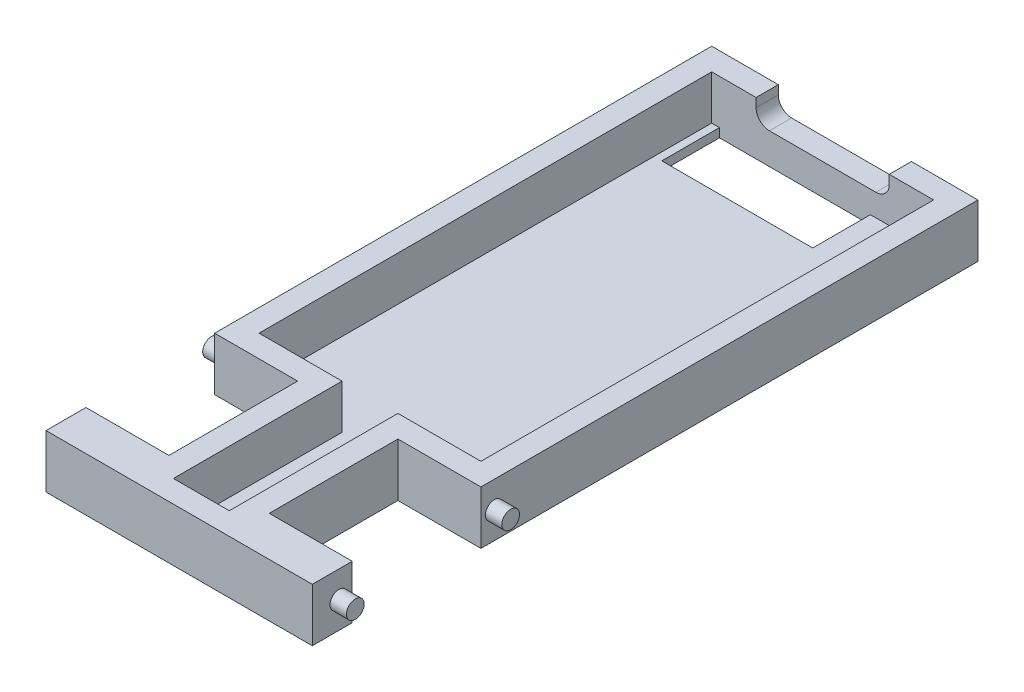
ISO-10303-21;
HEADER;
FILE_DESCRIPTION(('STEP AP214'),'2;1');
FILE_NAME('part.step','',(''),(''),'','','');
FILE_SCHEMA(('AUTOMOTIVE_DESIGN { 1 0 10303 214 1 1 1 1 }'));
ENDSEC;
DATA;
#1=APPLICATION_CONTEXT('core data for automotive mechanical design processes');
#2=APPLICATION_PROTOCOL_DEFINITION('international standard','automotive_design',2000,#1);
#3=PRODUCT_CONTEXT('',#1,'mechanical');
#4=PRODUCT('Part','Part','',(#3));
#5=PRODUCT_RELATED_PRODUCT_CATEGORY('part','',(#4));
#6=PRODUCT_DEFINITION_FORMATION('','',#4);
#7=PRODUCT_DEFINITION_CONTEXT('part definition',#1,'design');
#8=PRODUCT_DEFINITION('design','',#6,#7);
#9=PRODUCT_DEFINITION_SHAPE('','',#8);
#10=(LENGTH_UNIT() NAMED_UNIT(*) SI_UNIT(.MILLI.,.METRE.));
#11=(NAMED_UNIT(*) PLANE_ANGLE_UNIT() SI_UNIT($,.RADIAN.));
#12=(NAMED_UNIT(*) SI_UNIT($,.STERADIAN.) SOLID_ANGLE_UNIT());
#13=UNCERTAINTY_MEASURE_WITH_UNIT(LENGTH_MEASURE(1.E-05),#10,'distance_accuracy_value','');
#14=(GEOMETRIC_REPRESENTATION_CONTEXT(3) GLOBAL_UNCERTAINTY_ASSIGNED_CONTEXT((#13)) GLOBAL_UNIT_ASSIGNED_CONTEXT((#10,
#11,#12)) REPRESENTATION_CONTEXT('',''));
#15=CARTESIAN_POINT('',(0.,0.,0.));
#16=DIRECTION('',(0.,0.,1.));
#17=DIRECTION('',(1.,0.,0.));
#18=AXIS2_PLACEMENT_3D('',#15,#16,#17);
#19=CARTESIAN_POINT('',(60.,10.,0.));
#20=DIRECTION('',(1.,0.,0.));
#21=DIRECTION('',(0.,0.,-1.));
#22=AXIS2_PLACEMENT_3D('',#19,#20,#21);
#23=PLANE('',#22);
#24=CARTESIAN_POINT('',(60.,4.,144.));
#25=DIRECTION('',(1.,0.,0.));
#26=DIRECTION('',(0.,0.,-1.));
#27=AXIS2_PLACEMENT_3D('',#24,#25,#26);
#28=CIRCLE('',#27,2.);
#29=CARTESIAN_POINT('',(60.,4.,142.));
#30=VERTEX_POINT('',#29);
#31=EDGE_CURVE('E307',#30,#30,#28,.T.);
#32=ORIENTED_EDGE('',*,*,#31,.F.);
#33=EDGE_LOOP('',(#32));
#34=FACE_BOUND('',#33,.T.);
#35=DIRECTION('',(0.,0.,1.));
#36=VECTOR('',#35,1.);
#37=CARTESIAN_POINT('',(60.,-2.,0.));
#38=LINE('',#37,#36);
#39=CARTESIAN_POINT('',(60.,-2.,141.));
#40=VERTEX_POINT('',#39);
#41=CARTESIAN_POINT('',(60.,-2.,150.));
#42=VERTEX_POINT('',#41);
#43=EDGE_CURVE('E475',#40,#42,#38,.T.);
#44=ORIENTED_EDGE('',*,*,#43,.F.);
#45=DIRECTION('',(0.,1.,0.));
#46=VECTOR('',#45,1.);
#47=CARTESIAN_POINT('',(60.,-2.,141.));
#48=LINE('',#47,#46);
#49=CARTESIAN_POINT('',(60.,10.,141.));
#50=VERTEX_POINT('',#49);
#51=EDGE_CURVE('E428',#40,#50,#48,.T.);
#52=ORIENTED_EDGE('',*,*,#51,.T.);
#53=DIRECTION('',(0.,0.,1.));
#54=VECTOR('',#53,1.);
#55=CARTESIAN_POINT('',(60.,10.,0.));
#56=LINE('',#55,#54);
#57=CARTESIAN_POINT('',(60.,10.,150.));
#58=VERTEX_POINT('',#57);
#59=EDGE_CURVE('E284',#50,#58,#56,.T.);
#60=ORIENTED_EDGE('',*,*,#59,.T.);
#61=DIRECTION('',(0.,-1.,0.));
#62=VECTOR('',#61,1.);
#63=CARTESIAN_POINT('',(60.,10.,150.));
#64=LINE('',#63,#62);
#65=EDGE_CURVE('E270',#58,#42,#64,.T.);
#66=ORIENTED_EDGE('',*,*,#65,.T.);
#67=EDGE_LOOP('',(#44,#52,#60,#66));
#68=FACE_BOUND('',#67,.T.);
#69=ADVANCED_FACE('F36',(#34,#68),#23,.T.);
#70=CARTESIAN_POINT('',(0.,10.,0.));
#71=DIRECTION('',(1.,0.,0.));
#72=DIRECTION('',(0.,0.,-1.));
#73=AXIS2_PLACEMENT_3D('',#70,#71,#72);
#74=PLANE('',#73);
#75=CARTESIAN_POINT('',(0.,3.99999999999999,109.));
#76=DIRECTION('',(1.,0.,0.));
#77=DIRECTION('',(0.,0.,-1.));
#78=AXIS2_PLACEMENT_3D('',#75,#76,#77);
#79=CIRCLE('',#78,2.);
#80=CARTESIAN_POINT('',(0.,3.99999999999999,107.));
#81=VERTEX_POINT('',#80);
#82=EDGE_CURVE('E290',#81,#81,#79,.F.);
#83=ORIENTED_EDGE('',*,*,#82,.F.);
#84=EDGE_LOOP('',(#83));
#85=FACE_BOUND('',#84,.T.);
#86=DIRECTION('',(0.,1.,0.));
#87=VECTOR('',#86,1.);
#88=CARTESIAN_POINT('',(0.,-2.00000000000001,112.));
#89=LINE('',#88,#87);
#90=CARTESIAN_POINT('',(0.,-2.00000000000001,112.));
#91=VERTEX_POINT('',#90);
#92=CARTESIAN_POINT('',(0.,10.,112.));
#93=VERTEX_POINT('',#92);
#94=EDGE_CURVE('E457',#91,#93,#89,.T.);
#95=ORIENTED_EDGE('',*,*,#94,.T.);
#96=DIRECTION('',(0.,0.,1.));
#97=VECTOR('',#96,1.);
#98=CARTESIAN_POINT('',(0.,10.,0.));
#99=LINE('',#98,#97);
#100=CARTESIAN_POINT('',(0.,10.,0.));
#101=VERTEX_POINT('',#100);
#102=EDGE_CURVE('E259',#101,#93,#99,.T.);
#103=ORIENTED_EDGE('',*,*,#102,.F.);
#104=DIRECTION('',(0.,-1.,0.));
#105=VECTOR('',#104,1.);
#106=CARTESIAN_POINT('',(0.,10.,0.));
#107=LINE('',#106,#105);
#108=CARTESIAN_POINT('',(0.,-2.,0.));
#109=VERTEX_POINT('',#108);
#110=EDGE_CURVE('E296',#101,#109,#107,.T.);
#111=ORIENTED_EDGE('',*,*,#110,.T.);
#112=DIRECTION('',(0.,0.,1.));
#113=VECTOR('',#112,1.);
#114=CARTESIAN_POINT('',(0.,-2.,0.));
#115=LINE('',#114,#113);
#116=EDGE_CURVE('E489',#109,#91,#115,.T.);
#117=ORIENTED_EDGE('',*,*,#116,.T.);
#118=EDGE_LOOP('',(#95,#103,#111,#117));
#119=FACE_BOUND('',#118,.T.);
#120=ADVANCED_FACE('F543',(#85,#119),#74,.F.);
#121=CARTESIAN_POINT('',(5.00000000000002,10.,0.));
#122=DIRECTION('',(1.,0.,0.));
#123=DIRECTION('',(0.,0.,-1.));
#124=AXIS2_PLACEMENT_3D('',#121,#122,#123);
#125=PLANE('',#124);
#126=DIRECTION('',(0.,-1.,0.));
#127=VECTOR('',#126,1.);
#128=CARTESIAN_POINT('',(5.00000000000002,52.3519775217167,107.));
#129=LINE('',#128,#127);
#130=CARTESIAN_POINT('',(5.00000000000002,10.,107.));
#131=VERTEX_POINT('',#130);
#132=CARTESIAN_POINT('',(5.00000000000002,0.,107.));
#133=VERTEX_POINT('',#132);
#134=EDGE_CURVE('E410',#131,#133,#129,.T.);
#135=ORIENTED_EDGE('',*,*,#134,.T.);
#136=DIRECTION('',(0.,0.,1.));
#137=VECTOR('',#136,1.);
#138=CARTESIAN_POINT('',(5.00000000000002,0.,0.));
#139=LINE('',#138,#137);
#140=CARTESIAN_POINT('',(5.00000000000002,0.,5.));
#141=VERTEX_POINT('',#140);
#142=EDGE_CURVE('E281',#141,#133,#139,.T.);
#143=ORIENTED_EDGE('',*,*,#142,.F.);
#144=DIRECTION('',(0.,-1.,0.));
#145=VECTOR('',#144,1.);
#146=CARTESIAN_POINT('',(5.00000000000002,10.,5.));
#147=LINE('',#146,#145);
#148=CARTESIAN_POINT('',(5.00000000000002,10.,5.));
#149=VERTEX_POINT('',#148);
#150=EDGE_CURVE('E285',#149,#141,#147,.T.);
#151=ORIENTED_EDGE('',*,*,#150,.F.);
#152=DIRECTION('',(0.,0.,1.));
#153=VECTOR('',#152,1.);
#154=CARTESIAN_POINT('',(5.00000000000002,10.,0.));
#155=LINE('',#154,#153);
#156=EDGE_CURVE('E267',#149,#131,#155,.T.);
#157=ORIENTED_EDGE('',*,*,#156,.T.);
#158=EDGE_LOOP('',(#135,#143,#151,#157));
#159=FACE_BOUND('',#158,.T.);
#160=ADVANCED_FACE('F549',(#159),#125,.T.);
#161=CARTESIAN_POINT('',(0.,10.,5.));
#162=DIRECTION('',(0.,0.,-1.));
#163=DIRECTION('',(-1.,0.,0.));
#164=AXIS2_PLACEMENT_3D('',#161,#162,#163);
#165=PLANE('',#164);
#166=DIRECTION('',(1.,0.,0.));
#167=VECTOR('',#166,1.);
#168=CARTESIAN_POINT('',(0.,10.,5.));
#169=LINE('',#168,#167);
#170=CARTESIAN_POINT('',(45.,10.,5.));
#171=VERTEX_POINT('',#170);
#172=CARTESIAN_POINT('',(55.,10.,5.));
#173=VERTEX_POINT('',#172);
#174=EDGE_CURVE('E243',#171,#173,#169,.T.);
#175=ORIENTED_EDGE('',*,*,#174,.F.);
#176=DIRECTION('',(0.,1.,0.));
#177=VECTOR('',#176,1.);
#178=CARTESIAN_POINT('',(45.,10.,5.));
#179=LINE('',#178,#177);
#180=CARTESIAN_POINT('',(45.,8.,5.));
#181=VERTEX_POINT('',#180);
#182=EDGE_CURVE('E229',#181,#171,#179,.T.);
#183=ORIENTED_EDGE('',*,*,#182,.F.);
#184=CARTESIAN_POINT('',(42.,8.,5.));
#185=DIRECTION('',(0.,0.,-1.));
#186=DIRECTION('',(-1.,0.,0.));
#187=AXIS2_PLACEMENT_3D('',#184,#185,#186);
#188=CIRCLE('',#187,3.);
#189=CARTESIAN_POINT('',(42.,5.,5.));
#190=VERTEX_POINT('',#189);
#191=EDGE_CURVE('E11',#181,#190,#188,.T.);
#192=ORIENTED_EDGE('',*,*,#191,.T.);
#193=DIRECTION('',(1.,0.,0.));
#194=VECTOR('',#193,1.);
#195=CARTESIAN_POINT('',(45.,5.,5.));
#196=LINE('',#195,#194);
#197=CARTESIAN_POINT('',(18.,5.,5.));
#198=VERTEX_POINT('',#197);
#199=EDGE_CURVE('E237',#198,#190,#196,.T.);
#200=ORIENTED_EDGE('',*,*,#199,.F.);
#201=CARTESIAN_POINT('',(18.,8.,5.));
#202=DIRECTION('',(0.,0.,-1.));
#203=DIRECTION('',(-1.,0.,0.));
#204=AXIS2_PLACEMENT_3D('',#201,#202,#203);
#205=CIRCLE('',#204,3.);
#206=CARTESIAN_POINT('',(15.,8.,5.));
#207=VERTEX_POINT('',#206);
#208=EDGE_CURVE('E333',#198,#207,#205,.T.);
#209=ORIENTED_EDGE('',*,*,#208,.T.);
#210=DIRECTION('',(0.,-1.,0.));
#211=VECTOR('',#210,1.);
#212=CARTESIAN_POINT('',(15.,10.,5.));
#213=LINE('',#212,#211);
#214=CARTESIAN_POINT('',(15.,10.,5.));
#215=VERTEX_POINT('',#214);
#216=EDGE_CURVE('E236',#215,#207,#213,.T.);
#217=ORIENTED_EDGE('',*,*,#216,.F.);
#218=EDGE_CURVE('E253',#149,#215,#169,.T.);
#219=ORIENTED_EDGE('',*,*,#218,.F.);
#220=ORIENTED_EDGE('',*,*,#150,.T.);
#221=DIRECTION('',(1.,0.,0.));
#222=VECTOR('',#221,1.);
#223=CARTESIAN_POINT('',(0.,0.,5.));
#224=LINE('',#223,#222);
#225=CARTESIAN_POINT('',(6.75,0.,5.));
#226=VERTEX_POINT('',#225);
#227=EDGE_CURVE('E271',#141,#226,#224,.T.);
#228=ORIENTED_EDGE('',*,*,#227,.T.);
#229=DIRECTION('',(0.,-1.,0.));
#230=VECTOR('',#229,1.);
#231=CARTESIAN_POINT('',(6.75,10.,5.));
#232=LINE('',#231,#230);
#233=CARTESIAN_POINT('',(6.75,-2.,5.));
#234=VERTEX_POINT('',#233);
#235=EDGE_CURVE('E347',#226,#234,#232,.T.);
#236=ORIENTED_EDGE('',*,*,#235,.T.);
#237=DIRECTION('',(-1.,0.,0.));
#238=VECTOR('',#237,1.);
#239=CARTESIAN_POINT('',(0.,-2.,5.));
#240=LINE('',#239,#238);
#241=CARTESIAN_POINT('',(40.75,-2.,5.));
#242=VERTEX_POINT('',#241);
#243=EDGE_CURVE('E310',#242,#234,#240,.T.);
#244=ORIENTED_EDGE('',*,*,#243,.F.);
#245=DIRECTION('',(0.,-1.,0.));
#246=VECTOR('',#245,1.);
#247=CARTESIAN_POINT('',(40.75,10.,5.));
#248=LINE('',#247,#246);
#249=CARTESIAN_POINT('',(40.75,0.,5.));
#250=VERTEX_POINT('',#249);
#251=EDGE_CURVE('E372',#250,#242,#248,.T.);
#252=ORIENTED_EDGE('',*,*,#251,.F.);
#253=CARTESIAN_POINT('',(55.,0.,5.));
#254=VERTEX_POINT('',#253);
#255=EDGE_CURVE('E275',#250,#254,#224,.T.);
#256=ORIENTED_EDGE('',*,*,#255,.T.);
#257=DIRECTION('',(0.,-1.,0.));
#258=VECTOR('',#257,1.);
#259=CARTESIAN_POINT('',(55.,10.,5.));
#260=LINE('',#259,#258);
#261=EDGE_CURVE('E252',#173,#254,#260,.T.);
#262=ORIENTED_EDGE('',*,*,#261,.F.);
#263=EDGE_LOOP('',(#175,#183,#192,#200,#209,#217,#219,#220,#228,#236,#244,#252,#256,#262));
#264=FACE_BOUND('',#263,.T.);
#265=ADVANCED_FACE('F250',(#264),#165,.F.);
#266=CARTESIAN_POINT('',(55.,10.,0.));
#267=DIRECTION('',(1.,0.,0.));
#268=DIRECTION('',(0.,0.,-1.));
#269=AXIS2_PLACEMENT_3D('',#266,#267,#268);
#270=PLANE('',#269);
#271=DIRECTION('',(0.,0.,1.));
#272=VECTOR('',#271,1.);
#273=CARTESIAN_POINT('',(55.,0.,0.));
#274=LINE('',#273,#272);
#275=CARTESIAN_POINT('',(55.,0.,107.));
#276=VERTEX_POINT('',#275);
#277=EDGE_CURVE('E274',#254,#276,#274,.T.);
#278=ORIENTED_EDGE('',*,*,#277,.T.);
#279=DIRECTION('',(0.,-1.,0.));
#280=VECTOR('',#279,1.);
#281=CARTESIAN_POINT('',(55.,52.3519775217167,107.));
#282=LINE('',#281,#280);
#283=CARTESIAN_POINT('',(55.,10.,107.));
#284=VERTEX_POINT('',#283);
#285=EDGE_CURVE('E397',#284,#276,#282,.T.);
#286=ORIENTED_EDGE('',*,*,#285,.F.);
#287=DIRECTION('',(0.,0.,1.));
#288=VECTOR('',#287,1.);
#289=CARTESIAN_POINT('',(55.,10.,0.));
#290=LINE('',#289,#288);
#291=EDGE_CURVE('E257',#173,#284,#290,.T.);
#292=ORIENTED_EDGE('',*,*,#291,.F.);
#293=ORIENTED_EDGE('',*,*,#261,.T.);
#294=EDGE_LOOP('',(#278,#286,#292,#293));
#295=FACE_BOUND('',#294,.T.);
#296=ADVANCED_FACE('F561',(#295),#270,.F.);
#297=CARTESIAN_POINT('',(0.,10.,145.));
#298=DIRECTION('',(0.,0.,-1.));
#299=DIRECTION('',(-1.,0.,0.));
#300=AXIS2_PLACEMENT_3D('',#297,#298,#299);
#301=PLANE('',#300);
#302=DIRECTION('',(0.,-1.,0.));
#303=VECTOR('',#302,1.);
#304=CARTESIAN_POINT('',(36.3,52.3519775217167,145.));
#305=LINE('',#304,#303);
#306=CARTESIAN_POINT('',(36.3,10.,145.));
#307=VERTEX_POINT('',#306);
#308=CARTESIAN_POINT('',(36.3,0.,145.));
#309=VERTEX_POINT('',#308);
#310=EDGE_CURVE('E390',#307,#309,#305,.T.);
#311=ORIENTED_EDGE('',*,*,#310,.T.);
#312=DIRECTION('',(1.,0.,0.));
#313=VECTOR('',#312,1.);
#314=CARTESIAN_POINT('',(0.,0.,145.));
#315=LINE('',#314,#313);
#316=CARTESIAN_POINT('',(23.7,0.,145.));
#317=VERTEX_POINT('',#316);
#318=EDGE_CURVE('E278',#317,#309,#315,.T.);
#319=ORIENTED_EDGE('',*,*,#318,.F.);
#320=DIRECTION('',(0.,-1.,0.));
#321=VECTOR('',#320,1.);
#322=CARTESIAN_POINT('',(23.7,52.3519775217167,145.));
#323=LINE('',#322,#321);
#324=CARTESIAN_POINT('',(23.7,10.,145.));
#325=VERTEX_POINT('',#324);
#326=EDGE_CURVE('E417',#325,#317,#323,.T.);
#327=ORIENTED_EDGE('',*,*,#326,.F.);
#328=DIRECTION('',(1.,0.,0.));
#329=VECTOR('',#328,1.);
#330=CARTESIAN_POINT('',(0.,10.,145.));
#331=LINE('',#330,#329);
#332=EDGE_CURVE('E264',#325,#307,#331,.T.);
#333=ORIENTED_EDGE('',*,*,#332,.T.);
#334=EDGE_LOOP('',(#311,#319,#327,#333));
#335=FACE_BOUND('',#334,.T.);
#336=ADVANCED_FACE('F555',(#335),#301,.T.);
#337=CARTESIAN_POINT('',(60.,3.99999999999999,109.));
#338=DIRECTION('',(1.,0.,0.));
#339=DIRECTION('',(0.,0.,-1.));
#340=AXIS2_PLACEMENT_3D('',#337,#338,#339);
#341=CIRCLE('',#340,2.);
#342=CARTESIAN_POINT('',(60.,3.99999999999999,107.));
#343=VERTEX_POINT('',#342);
#344=EDGE_CURVE('E304',#343,#343,#341,.T.);
#345=ORIENTED_EDGE('',*,*,#344,.F.);
#346=EDGE_LOOP('',(#345));
#347=FACE_BOUND('',#346,.T.);
#348=DIRECTION('',(0.,1.,0.));
#349=VECTOR('',#348,1.);
#350=CARTESIAN_POINT('',(60.,-2.00000000000001,112.));
#351=LINE('',#350,#349);
#352=CARTESIAN_POINT('',(60.,-2.00000000000001,112.));
#353=VERTEX_POINT('',#352);
#354=CARTESIAN_POINT('',(60.,10.,112.));
#355=VERTEX_POINT('',#354);
#356=EDGE_CURVE('E433',#353,#355,#351,.T.);
#357=ORIENTED_EDGE('',*,*,#356,.F.);
#358=CARTESIAN_POINT('',(60.,-2.,0.));
#359=VERTEX_POINT('',#358);
#360=EDGE_CURVE('E482',#359,#353,#38,.T.);
#361=ORIENTED_EDGE('',*,*,#360,.F.);
#362=DIRECTION('',(0.,-1.,0.));
#363=VECTOR('',#362,1.);
#364=CARTESIAN_POINT('',(60.,10.,0.));
#365=LINE('',#364,#363);
#366=CARTESIAN_POINT('',(60.,10.,0.));
#367=VERTEX_POINT('',#366);
#368=EDGE_CURVE('E288',#367,#359,#365,.T.);
#369=ORIENTED_EDGE('',*,*,#368,.F.);
#370=EDGE_CURVE('E495',#367,#355,#56,.T.);
#371=ORIENTED_EDGE('',*,*,#370,.T.);
#372=EDGE_LOOP('',(#357,#361,#369,#371));
#373=FACE_BOUND('',#372,.T.);
#374=ADVANCED_FACE('F536',(#347,#373),#23,.T.);
#375=CARTESIAN_POINT('',(0.,10.,0.));
#376=DIRECTION('',(0.,0.,-1.));
#377=DIRECTION('',(-1.,0.,0.));
#378=AXIS2_PLACEMENT_3D('',#375,#376,#377);
#379=PLANE('',#378);
#380=DIRECTION('',(0.,-1.,0.));
#381=VECTOR('',#380,1.);
#382=CARTESIAN_POINT('',(45.,10.,0.));
#383=LINE('',#382,#381);
#384=CARTESIAN_POINT('',(45.,10.,0.));
#385=VERTEX_POINT('',#384);
#386=CARTESIAN_POINT('',(45.,8.,0.));
#387=VERTEX_POINT('',#386);
#388=EDGE_CURVE('E358',#385,#387,#383,.T.);
#389=ORIENTED_EDGE('',*,*,#388,.F.);
#390=DIRECTION('',(1.,0.,0.));
#391=VECTOR('',#390,1.);
#392=CARTESIAN_POINT('',(0.,10.,0.));
#393=LINE('',#392,#391);
#394=EDGE_CURVE('E246',#385,#367,#393,.T.);
#395=ORIENTED_EDGE('',*,*,#394,.T.);
#396=ORIENTED_EDGE('',*,*,#368,.T.);
#397=DIRECTION('',(1.,0.,0.));
#398=VECTOR('',#397,1.);
#399=CARTESIAN_POINT('',(0.,-2.,0.));
#400=LINE('',#399,#398);
#401=EDGE_CURVE('E485',#109,#359,#400,.T.);
#402=ORIENTED_EDGE('',*,*,#401,.F.);
#403=ORIENTED_EDGE('',*,*,#110,.F.);
#404=CARTESIAN_POINT('',(15.,10.,0.));
#405=VERTEX_POINT('',#404);
#406=EDGE_CURVE('E498',#101,#405,#393,.T.);
#407=ORIENTED_EDGE('',*,*,#406,.T.);
#408=DIRECTION('',(0.,1.,0.));
#409=VECTOR('',#408,1.);
#410=CARTESIAN_POINT('',(15.,10.,0.));
#411=LINE('',#410,#409);
#412=CARTESIAN_POINT('',(15.,8.,0.));
#413=VERTEX_POINT('',#412);
#414=EDGE_CURVE('E354',#413,#405,#411,.T.);
#415=ORIENTED_EDGE('',*,*,#414,.F.);
#416=CARTESIAN_POINT('',(18.,8.,0.));
#417=DIRECTION('',(0.,0.,-1.));
#418=DIRECTION('',(-1.,0.,0.));
#419=AXIS2_PLACEMENT_3D('',#416,#417,#418);
#420=CIRCLE('',#419,3.);
#421=CARTESIAN_POINT('',(18.,5.,0.));
#422=VERTEX_POINT('',#421);
#423=EDGE_CURVE('E331',#413,#422,#420,.F.);
#424=ORIENTED_EDGE('',*,*,#423,.T.);
#425=DIRECTION('',(-1.,0.,0.));
#426=VECTOR('',#425,1.);
#427=CARTESIAN_POINT('',(45.,5.,0.));
#428=LINE('',#427,#426);
#429=CARTESIAN_POINT('',(42.,5.,0.));
#430=VERTEX_POINT('',#429);
#431=EDGE_CURVE('E352',#430,#422,#428,.T.);
#432=ORIENTED_EDGE('',*,*,#431,.F.);
#433=CARTESIAN_POINT('',(42.,8.,0.));
#434=DIRECTION('',(0.,0.,-1.));
#435=DIRECTION('',(-1.,0.,0.));
#436=AXIS2_PLACEMENT_3D('',#433,#434,#435);
#437=CIRCLE('',#436,3.);
#438=EDGE_CURVE('E44',#430,#387,#437,.F.);
#439=ORIENTED_EDGE('',*,*,#438,.T.);
#440=EDGE_LOOP('',(#389,#395,#396,#402,#403,#407,#415,#424,#432,#439));
#441=FACE_BOUND('',#440,.T.);
#442=ADVANCED_FACE('F351',(#441),#379,.T.);
#443=CARTESIAN_POINT('',(0.,4.,144.));
#444=DIRECTION('',(1.,0.,0.));
#445=DIRECTION('',(0.,0.,-1.));
#446=AXIS2_PLACEMENT_3D('',#443,#444,#445);
#447=CIRCLE('',#446,2.);
#448=CARTESIAN_POINT('',(0.,4.,142.));
#449=VERTEX_POINT('',#448);
#450=EDGE_CURVE('E301',#449,#449,#447,.F.);
#451=ORIENTED_EDGE('',*,*,#450,.F.);
#452=EDGE_LOOP('',(#451));
#453=FACE_BOUND('',#452,.T.);
#454=CARTESIAN_POINT('',(0.,10.,141.));
#455=VERTEX_POINT('',#454);
#456=CARTESIAN_POINT('',(0.,10.,150.));
#457=VERTEX_POINT('',#456);
#458=EDGE_CURVE('E499',#455,#457,#99,.T.);
#459=ORIENTED_EDGE('',*,*,#458,.F.);
#460=DIRECTION('',(0.,1.,0.));
#461=VECTOR('',#460,1.);
#462=CARTESIAN_POINT('',(0.,-2.,141.));
#463=LINE('',#462,#461);
#464=CARTESIAN_POINT('',(0.,-2.,141.));
#465=VERTEX_POINT('',#464);
#466=EDGE_CURVE('E462',#465,#455,#463,.T.);
#467=ORIENTED_EDGE('',*,*,#466,.F.);
#468=CARTESIAN_POINT('',(0.,-2.,150.));
#469=VERTEX_POINT('',#468);
#470=EDGE_CURVE('E488',#465,#469,#115,.T.);
#471=ORIENTED_EDGE('',*,*,#470,.T.);
#472=DIRECTION('',(0.,-1.,0.));
#473=VECTOR('',#472,1.);
#474=CARTESIAN_POINT('',(0.,10.,150.));
#475=LINE('',#474,#473);
#476=EDGE_CURVE('E293',#457,#469,#475,.T.);
#477=ORIENTED_EDGE('',*,*,#476,.F.);
#478=EDGE_LOOP('',(#459,#467,#471,#477));
#479=FACE_BOUND('',#478,.T.);
#480=ADVANCED_FACE('F510',(#453,#479),#74,.F.);
#481=CARTESIAN_POINT('',(0.,10.,150.));
#482=DIRECTION('',(0.,0.,-1.));
#483=DIRECTION('',(-1.,0.,0.));
#484=AXIS2_PLACEMENT_3D('',#481,#482,#483);
#485=PLANE('',#484);
#486=ORIENTED_EDGE('',*,*,#476,.T.);
#487=DIRECTION('',(1.,0.,0.));
#488=VECTOR('',#487,1.);
#489=CARTESIAN_POINT('',(0.,-2.,150.));
#490=LINE('',#489,#488);
#491=EDGE_CURVE('E492',#469,#42,#490,.T.);
#492=ORIENTED_EDGE('',*,*,#491,.T.);
#493=ORIENTED_EDGE('',*,*,#65,.F.);
#494=DIRECTION('',(1.,0.,0.));
#495=VECTOR('',#494,1.);
#496=CARTESIAN_POINT('',(0.,10.,150.));
#497=LINE('',#496,#495);
#498=EDGE_CURVE('E254',#457,#58,#497,.T.);
#499=ORIENTED_EDGE('',*,*,#498,.F.);
#500=EDGE_LOOP('',(#486,#492,#493,#499));
#501=FACE_BOUND('',#500,.T.);
#502=ADVANCED_FACE('F514',(#501),#485,.F.);
#503=CARTESIAN_POINT('',(0.,10.,0.));
#504=DIRECTION('',(0.,1.,0.));
#505=DIRECTION('',(0.,0.,1.));
#506=AXIS2_PLACEMENT_3D('',#503,#504,#505);
#507=PLANE('',#506);
#508=DIRECTION('',(0.,0.,-1.));
#509=VECTOR('',#508,1.);
#510=CARTESIAN_POINT('',(45.,10.,150.001));
#511=LINE('',#510,#509);
#512=EDGE_CURVE('E232',#171,#385,#511,.T.);
#513=ORIENTED_EDGE('',*,*,#512,.F.);
#514=ORIENTED_EDGE('',*,*,#174,.T.);
#515=ORIENTED_EDGE('',*,*,#291,.T.);
#516=DIRECTION('',(1.,0.,0.));
#517=VECTOR('',#516,1.);
#518=CARTESIAN_POINT('',(0.,10.,107.));
#519=LINE('',#518,#517);
#520=CARTESIAN_POINT('',(36.3,10.,107.));
#521=VERTEX_POINT('',#520);
#522=EDGE_CURVE('E382',#521,#284,#519,.T.);
#523=ORIENTED_EDGE('',*,*,#522,.F.);
#524=DIRECTION('',(0.,0.,-1.));
#525=VECTOR('',#524,1.);
#526=CARTESIAN_POINT('',(36.3,10.,0.));
#527=LINE('',#526,#525);
#528=EDGE_CURVE('E394',#307,#521,#527,.T.);
#529=ORIENTED_EDGE('',*,*,#528,.F.);
#530=ORIENTED_EDGE('',*,*,#332,.F.);
#531=DIRECTION('',(0.,0.,1.));
#532=VECTOR('',#531,1.);
#533=CARTESIAN_POINT('',(23.7,10.,0.));
#534=LINE('',#533,#532);
#535=CARTESIAN_POINT('',(23.7,10.,107.));
#536=VERTEX_POINT('',#535);
#537=EDGE_CURVE('E393',#536,#325,#534,.T.);
#538=ORIENTED_EDGE('',*,*,#537,.F.);
#539=DIRECTION('',(1.,0.,0.));
#540=VECTOR('',#539,1.);
#541=CARTESIAN_POINT('',(0.,10.,107.));
#542=LINE('',#541,#540);
#543=EDGE_CURVE('E414',#131,#536,#542,.T.);
#544=ORIENTED_EDGE('',*,*,#543,.F.);
#545=ORIENTED_EDGE('',*,*,#156,.F.);
#546=ORIENTED_EDGE('',*,*,#218,.T.);
#547=DIRECTION('',(0.,0.,-1.));
#548=VECTOR('',#547,1.);
#549=CARTESIAN_POINT('',(15.,10.,150.001));
#550=LINE('',#549,#548);
#551=EDGE_CURVE('E247',#215,#405,#550,.T.);
#552=ORIENTED_EDGE('',*,*,#551,.T.);
#553=ORIENTED_EDGE('',*,*,#406,.F.);
#554=ORIENTED_EDGE('',*,*,#102,.T.);
#555=DIRECTION('',(-1.,0.,0.));
#556=VECTOR('',#555,1.);
#557=CARTESIAN_POINT('',(18.7,10.,112.));
#558=LINE('',#557,#556);
#559=CARTESIAN_POINT('',(18.7,10.,112.));
#560=VERTEX_POINT('',#559);
#561=EDGE_CURVE('E468',#560,#93,#558,.T.);
#562=ORIENTED_EDGE('',*,*,#561,.F.);
#563=DIRECTION('',(0.,0.,1.));
#564=VECTOR('',#563,1.);
#565=CARTESIAN_POINT('',(18.7,10.,0.));
#566=LINE('',#565,#564);
#567=CARTESIAN_POINT('',(18.7,10.,141.));
#568=VERTEX_POINT('',#567);
#569=EDGE_CURVE('E406',#560,#568,#566,.T.);
#570=ORIENTED_EDGE('',*,*,#569,.T.);
#571=DIRECTION('',(-1.,0.,0.));
#572=VECTOR('',#571,1.);
#573=CARTESIAN_POINT('',(18.7,10.,141.));
#574=LINE('',#573,#572);
#575=EDGE_CURVE('E472',#568,#455,#574,.T.);
#576=ORIENTED_EDGE('',*,*,#575,.T.);
#577=ORIENTED_EDGE('',*,*,#458,.T.);
#578=ORIENTED_EDGE('',*,*,#498,.T.);
#579=ORIENTED_EDGE('',*,*,#59,.F.);
#580=DIRECTION('',(1.,0.,0.));
#581=VECTOR('',#580,1.);
#582=CARTESIAN_POINT('',(41.3,10.,141.));
#583=LINE('',#582,#581);
#584=CARTESIAN_POINT('',(41.3,10.,141.));
#585=VERTEX_POINT('',#584);
#586=EDGE_CURVE('E438',#585,#50,#583,.T.);
#587=ORIENTED_EDGE('',*,*,#586,.F.);
#588=DIRECTION('',(0.,0.,-1.));
#589=VECTOR('',#588,1.);
#590=CARTESIAN_POINT('',(41.3,10.,0.));
#591=LINE('',#590,#589);
#592=CARTESIAN_POINT('',(41.3,10.,112.));
#593=VERTEX_POINT('',#592);
#594=EDGE_CURVE('E386',#585,#593,#591,.T.);
#595=ORIENTED_EDGE('',*,*,#594,.T.);
#596=DIRECTION('',(1.,0.,0.));
#597=VECTOR('',#596,1.);
#598=CARTESIAN_POINT('',(41.3,10.,112.));
#599=LINE('',#598,#597);
#600=EDGE_CURVE('E442',#593,#355,#599,.T.);
#601=ORIENTED_EDGE('',*,*,#600,.T.);
#602=ORIENTED_EDGE('',*,*,#370,.F.);
#603=ORIENTED_EDGE('',*,*,#394,.F.);
#604=EDGE_LOOP('',(#513,#514,#515,#523,#529,#530,#538,#544,#545,#546,#552,#553,#554,#562,#570,
#576,#577,#578,#579,#587,#595,#601,#602,#603));
#605=FACE_BOUND('',#604,.T.);
#606=ADVANCED_FACE('F241',(#605),#507,.T.);
#607=CARTESIAN_POINT('',(0.,0.,0.));
#608=DIRECTION('',(0.,1.,0.));
#609=DIRECTION('',(0.,0.,1.));
#610=AXIS2_PLACEMENT_3D('',#607,#608,#609);
#611=PLANE('',#610);
#612=DIRECTION('',(0.,0.,1.));
#613=VECTOR('',#612,1.);
#614=CARTESIAN_POINT('',(6.75,0.,0.));
#615=LINE('',#614,#613);
#616=CARTESIAN_POINT('',(6.75,0.,18.));
#617=VERTEX_POINT('',#616);
#618=EDGE_CURVE('E380',#226,#617,#615,.T.);
#619=ORIENTED_EDGE('',*,*,#618,.F.);
#620=ORIENTED_EDGE('',*,*,#227,.F.);
#621=ORIENTED_EDGE('',*,*,#142,.T.);
#622=DIRECTION('',(1.,0.,0.));
#623=VECTOR('',#622,1.);
#624=CARTESIAN_POINT('',(0.,0.,107.));
#625=LINE('',#624,#623);
#626=CARTESIAN_POINT('',(23.7,0.,107.));
#627=VERTEX_POINT('',#626);
#628=EDGE_CURVE('E403',#133,#627,#625,.T.);
#629=ORIENTED_EDGE('',*,*,#628,.T.);
#630=DIRECTION('',(0.,0.,1.));
#631=VECTOR('',#630,1.);
#632=CARTESIAN_POINT('',(23.7,0.,0.));
#633=LINE('',#632,#631);
#634=EDGE_CURVE('E407',#627,#317,#633,.T.);
#635=ORIENTED_EDGE('',*,*,#634,.T.);
#636=ORIENTED_EDGE('',*,*,#318,.T.);
#637=DIRECTION('',(0.,0.,-1.));
#638=VECTOR('',#637,1.);
#639=CARTESIAN_POINT('',(36.3,0.,0.));
#640=LINE('',#639,#638);
#641=CARTESIAN_POINT('',(36.3,0.,107.));
#642=VERTEX_POINT('',#641);
#643=EDGE_CURVE('E383',#309,#642,#640,.T.);
#644=ORIENTED_EDGE('',*,*,#643,.T.);
#645=DIRECTION('',(1.,0.,0.));
#646=VECTOR('',#645,1.);
#647=CARTESIAN_POINT('',(0.,0.,107.));
#648=LINE('',#647,#646);
#649=EDGE_CURVE('E387',#642,#276,#648,.T.);
#650=ORIENTED_EDGE('',*,*,#649,.T.);
#651=ORIENTED_EDGE('',*,*,#277,.F.);
#652=ORIENTED_EDGE('',*,*,#255,.F.);
#653=DIRECTION('',(0.,0.,-1.));
#654=VECTOR('',#653,1.);
#655=CARTESIAN_POINT('',(40.75,0.,0.));
#656=LINE('',#655,#654);
#657=CARTESIAN_POINT('',(40.75,0.,18.));
#658=VERTEX_POINT('',#657);
#659=EDGE_CURVE('E368',#658,#250,#656,.T.);
#660=ORIENTED_EDGE('',*,*,#659,.F.);
#661=DIRECTION('',(1.,0.,0.));
#662=VECTOR('',#661,1.);
#663=CARTESIAN_POINT('',(0.,0.,18.));
#664=LINE('',#663,#662);
#665=EDGE_CURVE('E378',#617,#658,#664,.T.);
#666=ORIENTED_EDGE('',*,*,#665,.F.);
#667=EDGE_LOOP('',(#619,#620,#621,#629,#635,#636,#644,#650,#651,#652,#660,#666));
#668=FACE_BOUND('',#667,.T.);
#669=ADVANCED_FACE('F615',(#668),#611,.T.);
#670=CARTESIAN_POINT('',(0.,-2.,0.));
#671=DIRECTION('',(0.,1.,0.));
#672=DIRECTION('',(0.,0.,1.));
#673=AXIS2_PLACEMENT_3D('',#670,#671,#672);
#674=PLANE('',#673);
#675=ORIENTED_EDGE('',*,*,#243,.T.);
#676=DIRECTION('',(0.,0.,1.));
#677=VECTOR('',#676,1.);
#678=CARTESIAN_POINT('',(6.75,-2.,0.));
#679=LINE('',#678,#677);
#680=CARTESIAN_POINT('',(6.75,-2.,18.));
#681=VERTEX_POINT('',#680);
#682=EDGE_CURVE('E319',#234,#681,#679,.T.);
#683=ORIENTED_EDGE('',*,*,#682,.T.);
#684=DIRECTION('',(1.,0.,0.));
#685=VECTOR('',#684,1.);
#686=CARTESIAN_POINT('',(0.,-2.,18.));
#687=LINE('',#686,#685);
#688=CARTESIAN_POINT('',(40.75,-2.,18.));
#689=VERTEX_POINT('',#688);
#690=EDGE_CURVE('E316',#681,#689,#687,.T.);
#691=ORIENTED_EDGE('',*,*,#690,.T.);
#692=DIRECTION('',(0.,0.,-1.));
#693=VECTOR('',#692,1.);
#694=CARTESIAN_POINT('',(40.75,-2.,0.));
#695=LINE('',#694,#693);
#696=EDGE_CURVE('E313',#689,#242,#695,.T.);
#697=ORIENTED_EDGE('',*,*,#696,.T.);
#698=EDGE_LOOP('',(#675,#683,#691,#697));
#699=FACE_BOUND('',#698,.T.);
#700=ORIENTED_EDGE('',*,*,#360,.T.);
#701=DIRECTION('',(1.,0.,0.));
#702=VECTOR('',#701,1.);
#703=CARTESIAN_POINT('',(41.3,-2.00000000000001,112.));
#704=LINE('',#703,#702);
#705=CARTESIAN_POINT('',(41.3,-2.00000000000001,112.));
#706=VERTEX_POINT('',#705);
#707=EDGE_CURVE('E446',#706,#353,#704,.T.);
#708=ORIENTED_EDGE('',*,*,#707,.F.);
#709=DIRECTION('',(0.,0.,-1.));
#710=VECTOR('',#709,1.);
#711=CARTESIAN_POINT('',(41.3,-2.,141.));
#712=LINE('',#711,#710);
#713=CARTESIAN_POINT('',(41.3,-2.,141.));
#714=VERTEX_POINT('',#713);
#715=EDGE_CURVE('E432',#714,#706,#712,.T.);
#716=ORIENTED_EDGE('',*,*,#715,.F.);
#717=DIRECTION('',(1.,0.,0.));
#718=VECTOR('',#717,1.);
#719=CARTESIAN_POINT('',(41.3,-2.,141.));
#720=LINE('',#719,#718);
#721=EDGE_CURVE('E448',#714,#40,#720,.T.);
#722=ORIENTED_EDGE('',*,*,#721,.T.);
#723=ORIENTED_EDGE('',*,*,#43,.T.);
#724=ORIENTED_EDGE('',*,*,#491,.F.);
#725=ORIENTED_EDGE('',*,*,#470,.F.);
#726=DIRECTION('',(-1.,0.,0.));
#727=VECTOR('',#726,1.);
#728=CARTESIAN_POINT('',(18.7,-2.,141.));
#729=LINE('',#728,#727);
#730=CARTESIAN_POINT('',(18.7,-2.,141.));
#731=VERTEX_POINT('',#730);
#732=EDGE_CURVE('E476',#731,#465,#729,.T.);
#733=ORIENTED_EDGE('',*,*,#732,.F.);
#734=DIRECTION('',(0.,0.,-1.));
#735=VECTOR('',#734,1.);
#736=CARTESIAN_POINT('',(18.7,-2.,141.));
#737=LINE('',#736,#735);
#738=CARTESIAN_POINT('',(18.7,-2.,112.));
#739=VERTEX_POINT('',#738);
#740=EDGE_CURVE('E461',#731,#739,#737,.T.);
#741=ORIENTED_EDGE('',*,*,#740,.T.);
#742=DIRECTION('',(-1.,0.,0.));
#743=VECTOR('',#742,1.);
#744=CARTESIAN_POINT('',(18.7,-2.00000000000001,112.));
#745=LINE('',#744,#743);
#746=EDGE_CURVE('E478',#739,#91,#745,.T.);
#747=ORIENTED_EDGE('',*,*,#746,.T.);
#748=ORIENTED_EDGE('',*,*,#116,.F.);
#749=ORIENTED_EDGE('',*,*,#401,.T.);
#750=EDGE_LOOP('',(#700,#708,#716,#722,#723,#724,#725,#733,#741,#747,#748,#749));
#751=FACE_BOUND('',#750,.T.);
#752=ADVANCED_FACE('F530',(#699,#751),#674,.F.);
#753=CARTESIAN_POINT('',(18.7,-2.,141.));
#754=DIRECTION('',(0.,0.,1.));
#755=DIRECTION('',(1.,0.,0.));
#756=AXIS2_PLACEMENT_3D('',#753,#754,#755);
#757=PLANE('',#756);
#758=ORIENTED_EDGE('',*,*,#575,.F.);
#759=DIRECTION('',(0.,1.,0.));
#760=VECTOR('',#759,1.);
#761=CARTESIAN_POINT('',(18.7,-2.,141.));
#762=LINE('',#761,#760);
#763=EDGE_CURVE('E465',#731,#568,#762,.T.);
#764=ORIENTED_EDGE('',*,*,#763,.F.);
#765=ORIENTED_EDGE('',*,*,#732,.T.);
#766=ORIENTED_EDGE('',*,*,#466,.T.);
#767=EDGE_LOOP('',(#758,#764,#765,#766));
#768=FACE_BOUND('',#767,.T.);
#769=ADVANCED_FACE('F606',(#768),#757,.F.);
#770=CARTESIAN_POINT('',(18.7,-2.00000000000001,112.));
#771=DIRECTION('',(0.,0.,1.));
#772=DIRECTION('',(1.,0.,0.));
#773=AXIS2_PLACEMENT_3D('',#770,#771,#772);
#774=PLANE('',#773);
#775=ORIENTED_EDGE('',*,*,#561,.T.);
#776=ORIENTED_EDGE('',*,*,#94,.F.);
#777=ORIENTED_EDGE('',*,*,#746,.F.);
#778=DIRECTION('',(0.,1.,0.));
#779=VECTOR('',#778,1.);
#780=CARTESIAN_POINT('',(18.7,-2.00000000000001,112.));
#781=LINE('',#780,#779);
#782=EDGE_CURVE('E458',#739,#560,#781,.T.);
#783=ORIENTED_EDGE('',*,*,#782,.T.);
#784=EDGE_LOOP('',(#775,#776,#777,#783));
#785=FACE_BOUND('',#784,.T.);
#786=ADVANCED_FACE('F604',(#785),#774,.T.);
#787=CARTESIAN_POINT('',(18.7,0.,0.));
#788=DIRECTION('',(1.,0.,0.));
#789=DIRECTION('',(0.,0.,-1.));
#790=AXIS2_PLACEMENT_3D('',#787,#788,#789);
#791=PLANE('',#790);
#792=ORIENTED_EDGE('',*,*,#763,.T.);
#793=ORIENTED_EDGE('',*,*,#569,.F.);
#794=ORIENTED_EDGE('',*,*,#782,.F.);
#795=ORIENTED_EDGE('',*,*,#740,.F.);
#796=EDGE_LOOP('',(#792,#793,#794,#795));
#797=FACE_BOUND('',#796,.T.);
#798=ADVANCED_FACE('F600',(#797),#791,.F.);
#799=CARTESIAN_POINT('',(-3.69999999999999,3.99999999999999,109.));
#800=DIRECTION('',(1.,0.,0.));
#801=DIRECTION('',(0.,0.,-1.));
#802=AXIS2_PLACEMENT_3D('',#799,#800,#801);
#803=CYLINDRICAL_SURFACE('',#802,2.);
#804=CARTESIAN_POINT('',(-3.69999999999999,3.99999999999999,109.));
#805=DIRECTION('',(-1.,0.,0.));
#806=DIRECTION('',(0.,0.,1.));
#807=AXIS2_PLACEMENT_3D('',#804,#805,#806);
#808=CIRCLE('',#807,2.);
#809=CARTESIAN_POINT('',(-3.69999999999999,3.99999999999999,111.));
#810=VERTEX_POINT('',#809);
#811=EDGE_CURVE('E454',#810,#810,#808,.T.);
#812=ORIENTED_EDGE('',*,*,#811,.F.);
#813=EDGE_LOOP('',(#812));
#814=FACE_BOUND('',#813,.T.);
#815=ORIENTED_EDGE('',*,*,#82,.T.);
#816=EDGE_LOOP('',(#815));
#817=FACE_BOUND('',#816,.T.);
#818=ADVANCED_FACE('F596',(#814,#817),#803,.T.);
#819=CARTESIAN_POINT('',(-3.7,0.,0.));
#820=DIRECTION('',(-1.,0.,0.));
#821=DIRECTION('',(0.,0.,1.));
#822=AXIS2_PLACEMENT_3D('',#819,#820,#821);
#823=PLANE('',#822);
#824=ORIENTED_EDGE('',*,*,#811,.T.);
#825=EDGE_LOOP('',(#824));
#826=FACE_BOUND('',#825,.T.);
#827=ADVANCED_FACE('F592',(#826),#823,.T.);
#828=CARTESIAN_POINT('',(-3.69999999999998,4.,144.));
#829=DIRECTION('',(1.,0.,0.));
#830=DIRECTION('',(0.,0.,-1.));
#831=AXIS2_PLACEMENT_3D('',#828,#829,#830);
#832=CYLINDRICAL_SURFACE('',#831,2.);
#833=CARTESIAN_POINT('',(-3.69999999999998,4.,144.));
#834=DIRECTION('',(-1.,0.,0.));
#835=DIRECTION('',(0.,0.,1.));
#836=AXIS2_PLACEMENT_3D('',#833,#834,#835);
#837=CIRCLE('',#836,2.);
#838=CARTESIAN_POINT('',(-3.69999999999998,4.,146.));
#839=VERTEX_POINT('',#838);
#840=EDGE_CURVE('E445',#839,#839,#837,.T.);
#841=ORIENTED_EDGE('',*,*,#840,.F.);
#842=EDGE_LOOP('',(#841));
#843=FACE_BOUND('',#842,.T.);
#844=ORIENTED_EDGE('',*,*,#450,.T.);
#845=EDGE_LOOP('',(#844));
#846=FACE_BOUND('',#845,.T.);
#847=ADVANCED_FACE('F588',(#843,#846),#832,.T.);
#848=CARTESIAN_POINT('',(-3.7,0.,0.));
#849=DIRECTION('',(-1.,0.,0.));
#850=DIRECTION('',(0.,0.,1.));
#851=AXIS2_PLACEMENT_3D('',#848,#849,#850);
#852=PLANE('',#851);
#853=ORIENTED_EDGE('',*,*,#840,.T.);
#854=EDGE_LOOP('',(#853));
#855=FACE_BOUND('',#854,.T.);
#856=ADVANCED_FACE('F583',(#855),#852,.T.);
#857=CARTESIAN_POINT('',(41.3,-2.00000000000001,112.));
#858=DIRECTION('',(0.,0.,-1.));
#859=DIRECTION('',(-1.,0.,0.));
#860=AXIS2_PLACEMENT_3D('',#857,#858,#859);
#861=PLANE('',#860);
#862=ORIENTED_EDGE('',*,*,#600,.F.);
#863=DIRECTION('',(0.,1.,0.));
#864=VECTOR('',#863,1.);
#865=CARTESIAN_POINT('',(41.3,-2.00000000000001,112.));
#866=LINE('',#865,#864);
#867=EDGE_CURVE('E435',#706,#593,#866,.T.);
#868=ORIENTED_EDGE('',*,*,#867,.F.);
#869=ORIENTED_EDGE('',*,*,#707,.T.);
#870=ORIENTED_EDGE('',*,*,#356,.T.);
#871=EDGE_LOOP('',(#862,#868,#869,#870));
#872=FACE_BOUND('',#871,.T.);
#873=ADVANCED_FACE('F527',(#872),#861,.F.);
#874=CARTESIAN_POINT('',(41.3,-2.,141.));
#875=DIRECTION('',(0.,0.,-1.));
#876=DIRECTION('',(-1.,0.,0.));
#877=AXIS2_PLACEMENT_3D('',#874,#875,#876);
#878=PLANE('',#877);
#879=DIRECTION('',(0.,1.,0.));
#880=VECTOR('',#879,1.);
#881=CARTESIAN_POINT('',(41.3,-2.,141.));
#882=LINE('',#881,#880);
#883=EDGE_CURVE('E429',#714,#585,#882,.T.);
#884=ORIENTED_EDGE('',*,*,#883,.T.);
#885=ORIENTED_EDGE('',*,*,#586,.T.);
#886=ORIENTED_EDGE('',*,*,#51,.F.);
#887=ORIENTED_EDGE('',*,*,#721,.F.);
#888=EDGE_LOOP('',(#884,#885,#886,#887));
#889=FACE_BOUND('',#888,.T.);
#890=ADVANCED_FACE('F520',(#889),#878,.T.);
#891=CARTESIAN_POINT('',(41.3,0.,0.));
#892=DIRECTION('',(-1.,0.,0.));
#893=DIRECTION('',(0.,0.,-1.));
#894=AXIS2_PLACEMENT_3D('',#891,#892,#893);
#895=PLANE('',#894);
#896=ORIENTED_EDGE('',*,*,#867,.T.);
#897=ORIENTED_EDGE('',*,*,#594,.F.);
#898=ORIENTED_EDGE('',*,*,#883,.F.);
#899=ORIENTED_EDGE('',*,*,#715,.T.);
#900=EDGE_LOOP('',(#896,#897,#898,#899));
#901=FACE_BOUND('',#900,.T.);
#902=ADVANCED_FACE('F523',(#901),#895,.F.);
#903=CARTESIAN_POINT('',(63.7,3.99999999999999,109.));
#904=DIRECTION('',(-1.,0.,0.));
#905=DIRECTION('',(0.,0.,1.));
#906=AXIS2_PLACEMENT_3D('',#903,#904,#905);
#907=CYLINDRICAL_SURFACE('',#906,2.);
#908=CARTESIAN_POINT('',(63.7,3.99999999999999,109.));
#909=DIRECTION('',(-1.,0.,0.));
#910=DIRECTION('',(0.,0.,1.));
#911=AXIS2_PLACEMENT_3D('',#908,#909,#910);
#912=CIRCLE('',#911,2.);
#913=CARTESIAN_POINT('',(63.7,3.99999999999999,111.));
#914=VERTEX_POINT('',#913);
#915=EDGE_CURVE('E425',#914,#914,#912,.T.);
#916=ORIENTED_EDGE('',*,*,#915,.T.);
#917=EDGE_LOOP('',(#916));
#918=FACE_BOUND('',#917,.T.);
#919=ORIENTED_EDGE('',*,*,#344,.T.);
#920=EDGE_LOOP('',(#919));
#921=FACE_BOUND('',#920,.T.);
#922=ADVANCED_FACE('F566',(#918,#921),#907,.T.);
#923=CARTESIAN_POINT('',(63.7,0.,0.));
#924=DIRECTION('',(1.,0.,0.));
#925=DIRECTION('',(0.,0.,1.));
#926=AXIS2_PLACEMENT_3D('',#923,#924,#925);
#927=PLANE('',#926);
#928=ORIENTED_EDGE('',*,*,#915,.F.);
#929=EDGE_LOOP('',(#928));
#930=FACE_BOUND('',#929,.T.);
#931=ADVANCED_FACE('F568',(#930),#927,.T.);
#932=CARTESIAN_POINT('',(63.7,4.,144.));
#933=DIRECTION('',(-1.,0.,0.));
#934=DIRECTION('',(0.,0.,1.));
#935=AXIS2_PLACEMENT_3D('',#932,#933,#934);
#936=CYLINDRICAL_SURFACE('',#935,2.);
#937=CARTESIAN_POINT('',(63.7,4.,144.));
#938=DIRECTION('',(-1.,0.,0.));
#939=DIRECTION('',(0.,0.,1.));
#940=AXIS2_PLACEMENT_3D('',#937,#938,#939);
#941=CIRCLE('',#940,2.);
#942=CARTESIAN_POINT('',(63.7,4.,146.));
#943=VERTEX_POINT('',#942);
#944=EDGE_CURVE('E413',#943,#943,#941,.T.);
#945=ORIENTED_EDGE('',*,*,#944,.T.);
#946=EDGE_LOOP('',(#945));
#947=FACE_BOUND('',#946,.T.);
#948=ORIENTED_EDGE('',*,*,#31,.T.);
#949=EDGE_LOOP('',(#948));
#950=FACE_BOUND('',#949,.T.);
#951=ADVANCED_FACE('F575',(#947,#950),#936,.T.);
#952=CARTESIAN_POINT('',(63.7,0.,0.));
#953=DIRECTION('',(1.,0.,0.));
#954=DIRECTION('',(0.,0.,1.));
#955=AXIS2_PLACEMENT_3D('',#952,#953,#954);
#956=PLANE('',#955);
#957=ORIENTED_EDGE('',*,*,#944,.F.);
#958=EDGE_LOOP('',(#957));
#959=FACE_BOUND('',#958,.T.);
#960=ADVANCED_FACE('F713',(#959),#956,.T.);
#961=CARTESIAN_POINT('',(23.7,52.3519775217167,0.));
#962=DIRECTION('',(1.,0.,0.));
#963=DIRECTION('',(0.,0.,-1.));
#964=AXIS2_PLACEMENT_3D('',#961,#962,#963);
#965=PLANE('',#964);
#966=DIRECTION('',(0.,-1.,0.));
#967=VECTOR('',#966,1.);
#968=CARTESIAN_POINT('',(23.7,52.3519775217167,107.));
#969=LINE('',#968,#967);
#970=EDGE_CURVE('E416',#536,#627,#969,.T.);
#971=ORIENTED_EDGE('',*,*,#970,.F.);
#972=ORIENTED_EDGE('',*,*,#537,.T.);
#973=ORIENTED_EDGE('',*,*,#326,.T.);
#974=ORIENTED_EDGE('',*,*,#634,.F.);
#975=EDGE_LOOP('',(#971,#972,#973,#974));
#976=FACE_BOUND('',#975,.T.);
#977=ADVANCED_FACE('F708',(#976),#965,.T.);
#978=CARTESIAN_POINT('',(0.,52.3519775217167,107.));
#979=DIRECTION('',(0.,0.,-1.));
#980=DIRECTION('',(-1.,0.,0.));
#981=AXIS2_PLACEMENT_3D('',#978,#979,#980);
#982=PLANE('',#981);
#983=ORIENTED_EDGE('',*,*,#134,.F.);
#984=ORIENTED_EDGE('',*,*,#543,.T.);
#985=ORIENTED_EDGE('',*,*,#970,.T.);
#986=ORIENTED_EDGE('',*,*,#628,.F.);
#987=EDGE_LOOP('',(#983,#984,#985,#986));
#988=FACE_BOUND('',#987,.T.);
#989=ADVANCED_FACE('F712',(#988),#982,.T.);
#990=CARTESIAN_POINT('',(0.,52.3519775217167,107.));
#991=DIRECTION('',(0.,0.,-1.));
#992=DIRECTION('',(-1.,0.,0.));
#993=AXIS2_PLACEMENT_3D('',#990,#991,#992);
#994=PLANE('',#993);
#995=DIRECTION('',(0.,-1.,0.));
#996=VECTOR('',#995,1.);
#997=CARTESIAN_POINT('',(36.3,52.3519775217167,107.));
#998=LINE('',#997,#996);
#999=EDGE_CURVE('E396',#521,#642,#998,.T.);
#1000=ORIENTED_EDGE('',*,*,#999,.F.);
#1001=ORIENTED_EDGE('',*,*,#522,.T.);
#1002=ORIENTED_EDGE('',*,*,#285,.T.);
#1003=ORIENTED_EDGE('',*,*,#649,.F.);
#1004=EDGE_LOOP('',(#1000,#1001,#1002,#1003));
#1005=FACE_BOUND('',#1004,.T.);
#1006=ADVANCED_FACE('F724',(#1005),#994,.T.);
#1007=CARTESIAN_POINT('',(36.3,52.3519775217167,0.));
#1008=DIRECTION('',(-1.,0.,0.));
#1009=DIRECTION('',(0.,0.,1.));
#1010=AXIS2_PLACEMENT_3D('',#1007,#1008,#1009);
#1011=PLANE('',#1010);
#1012=ORIENTED_EDGE('',*,*,#310,.F.);
#1013=ORIENTED_EDGE('',*,*,#528,.T.);
#1014=ORIENTED_EDGE('',*,*,#999,.T.);
#1015=ORIENTED_EDGE('',*,*,#643,.F.);
#1016=EDGE_LOOP('',(#1012,#1013,#1014,#1015));
#1017=FACE_BOUND('',#1016,.T.);
#1018=ADVANCED_FACE('F733',(#1017),#1011,.T.);
#1019=CARTESIAN_POINT('',(6.75,10.,5.));
#1020=DIRECTION('',(-1.,0.,0.));
#1021=DIRECTION('',(0.,0.,1.));
#1022=AXIS2_PLACEMENT_3D('',#1019,#1020,#1021);
#1023=PLANE('',#1022);
#1024=ORIENTED_EDGE('',*,*,#618,.T.);
#1025=DIRECTION('',(0.,-1.,0.));
#1026=VECTOR('',#1025,1.);
#1027=CARTESIAN_POINT('',(6.75,10.,18.));
#1028=LINE('',#1027,#1026);
#1029=EDGE_CURVE('E365',#617,#681,#1028,.T.);
#1030=ORIENTED_EDGE('',*,*,#1029,.T.);
#1031=ORIENTED_EDGE('',*,*,#682,.F.);
#1032=ORIENTED_EDGE('',*,*,#235,.F.);
#1033=EDGE_LOOP('',(#1024,#1030,#1031,#1032));
#1034=FACE_BOUND('',#1033,.T.);
#1035=ADVANCED_FACE('F742',(#1034),#1023,.F.);
#1036=CARTESIAN_POINT('',(6.75,10.,18.));
#1037=DIRECTION('',(0.,0.,1.));
#1038=DIRECTION('',(1.,0.,0.));
#1039=AXIS2_PLACEMENT_3D('',#1036,#1037,#1038);
#1040=PLANE('',#1039);
#1041=ORIENTED_EDGE('',*,*,#665,.T.);
#1042=DIRECTION('',(0.,-1.,0.));
#1043=VECTOR('',#1042,1.);
#1044=CARTESIAN_POINT('',(40.75,10.,18.));
#1045=LINE('',#1044,#1043);
#1046=EDGE_CURVE('E369',#658,#689,#1045,.T.);
#1047=ORIENTED_EDGE('',*,*,#1046,.T.);
#1048=ORIENTED_EDGE('',*,*,#690,.F.);
#1049=ORIENTED_EDGE('',*,*,#1029,.F.);
#1050=EDGE_LOOP('',(#1041,#1047,#1048,#1049));
#1051=FACE_BOUND('',#1050,.T.);
#1052=ADVANCED_FACE('F752',(#1051),#1040,.F.);
#1053=CARTESIAN_POINT('',(40.75,10.,5.));
#1054=DIRECTION('',(1.,0.,0.));
#1055=DIRECTION('',(0.,0.,-1.));
#1056=AXIS2_PLACEMENT_3D('',#1053,#1054,#1055);
#1057=PLANE('',#1056);
#1058=ORIENTED_EDGE('',*,*,#659,.T.);
#1059=ORIENTED_EDGE('',*,*,#251,.T.);
#1060=ORIENTED_EDGE('',*,*,#696,.F.);
#1061=ORIENTED_EDGE('',*,*,#1046,.F.);
#1062=EDGE_LOOP('',(#1058,#1059,#1060,#1061));
#1063=FACE_BOUND('',#1062,.T.);
#1064=ADVANCED_FACE('F760',(#1063),#1057,.F.);
#1065=CARTESIAN_POINT('',(45.,10.,150.001));
#1066=DIRECTION('',(1.,0.,0.));
#1067=DIRECTION('',(0.,0.,-1.));
#1068=AXIS2_PLACEMENT_3D('',#1065,#1066,#1067);
#1069=PLANE('',#1068);
#1070=ORIENTED_EDGE('',*,*,#388,.T.);
#1071=DIRECTION('',(0.,0.,-1.));
#1072=VECTOR('',#1071,1.);
#1073=CARTESIAN_POINT('',(45.,8.,5.));
#1074=LINE('',#1073,#1072);
#1075=EDGE_CURVE('E57',#387,#181,#1074,.F.);
#1076=ORIENTED_EDGE('',*,*,#1075,.T.);
#1077=ORIENTED_EDGE('',*,*,#182,.T.);
#1078=ORIENTED_EDGE('',*,*,#512,.T.);
#1079=EDGE_LOOP('',(#1070,#1076,#1077,#1078));
#1080=FACE_BOUND('',#1079,.T.);
#1081=ADVANCED_FACE('F231',(#1080),#1069,.F.);
#1082=CARTESIAN_POINT('',(15.,10.,150.001));
#1083=DIRECTION('',(-1.,0.,0.));
#1084=DIRECTION('',(0.,0.,1.));
#1085=AXIS2_PLACEMENT_3D('',#1082,#1083,#1084);
#1086=PLANE('',#1085);
#1087=ORIENTED_EDGE('',*,*,#216,.T.);
#1088=DIRECTION('',(0.,0.,-1.));
#1089=VECTOR('',#1088,1.);
#1090=CARTESIAN_POINT('',(15.,8.,0.));
#1091=LINE('',#1090,#1089);
#1092=EDGE_CURVE('E322',#207,#413,#1091,.T.);
#1093=ORIENTED_EDGE('',*,*,#1092,.T.);
#1094=ORIENTED_EDGE('',*,*,#414,.T.);
#1095=ORIENTED_EDGE('',*,*,#551,.F.);
#1096=EDGE_LOOP('',(#1087,#1093,#1094,#1095));
#1097=FACE_BOUND('',#1096,.T.);
#1098=ADVANCED_FACE('F344',(#1097),#1086,.F.);
#1099=CARTESIAN_POINT('',(45.,5.,150.001));
#1100=DIRECTION('',(0.,-1.,0.));
#1101=DIRECTION('',(0.,0.,-1.));
#1102=AXIS2_PLACEMENT_3D('',#1099,#1100,#1101);
#1103=PLANE('',#1102);
#1104=ORIENTED_EDGE('',*,*,#431,.T.);
#1105=DIRECTION('',(0.,0.,-1.));
#1106=VECTOR('',#1105,1.);
#1107=CARTESIAN_POINT('',(18.,5.,5.));
#1108=LINE('',#1107,#1106);
#1109=EDGE_CURVE('E328',#422,#198,#1108,.F.);
#1110=ORIENTED_EDGE('',*,*,#1109,.T.);
#1111=ORIENTED_EDGE('',*,*,#199,.T.);
#1112=DIRECTION('',(0.,0.,-1.));
#1113=VECTOR('',#1112,1.);
#1114=CARTESIAN_POINT('',(42.,5.,0.));
#1115=LINE('',#1114,#1113);
#1116=EDGE_CURVE('E325',#190,#430,#1115,.T.);
#1117=ORIENTED_EDGE('',*,*,#1116,.T.);
#1118=EDGE_LOOP('',(#1104,#1110,#1111,#1117));
#1119=FACE_BOUND('',#1118,.T.);
#1120=ADVANCED_FACE('F356',(#1119),#1103,.F.);
#1121=CARTESIAN_POINT('',(18.,8.,150.001));
#1122=DIRECTION('',(0.,0.,1.));
#1123=DIRECTION('',(1.,0.,0.));
#1124=AXIS2_PLACEMENT_3D('',#1121,#1122,#1123);
#1125=CYLINDRICAL_SURFACE('',#1124,3.);
#1126=ORIENTED_EDGE('',*,*,#208,.F.);
#1127=ORIENTED_EDGE('',*,*,#1109,.F.);
#1128=ORIENTED_EDGE('',*,*,#423,.F.);
#1129=ORIENTED_EDGE('',*,*,#1092,.F.);
#1130=EDGE_LOOP('',(#1126,#1127,#1128,#1129));
#1131=FACE_BOUND('',#1130,.T.);
#1132=ADVANCED_FACE('F349',(#1131),#1125,.F.);
#1133=CARTESIAN_POINT('',(42.,8.,150.001));
#1134=DIRECTION('',(0.,0.,1.));
#1135=DIRECTION('',(1.,0.,0.));
#1136=AXIS2_PLACEMENT_3D('',#1133,#1134,#1135);
#1137=CYLINDRICAL_SURFACE('',#1136,3.);
#1138=ORIENTED_EDGE('',*,*,#191,.F.);
#1139=ORIENTED_EDGE('',*,*,#1075,.F.);
#1140=ORIENTED_EDGE('',*,*,#438,.F.);
#1141=ORIENTED_EDGE('',*,*,#1116,.F.);
#1142=EDGE_LOOP('',(#1138,#1139,#1140,#1141));
#1143=FACE_BOUND('',#1142,.T.);
#1144=ADVANCED_FACE('F38',(#1143),#1137,.F.);
#1145=CLOSED_SHELL('',(#69,#120,#160,#265,#296,#336,#374,#442,#480,#502,#606,#669,#752,#769,
#786,#798,#818,#827,#847,#856,#873,#890,#902,#922,#931,#951,#960,#977,#989,#1006,#1018,#1035,
#1052,#1064,#1081,#1098,#1120,#1132,#1144));
#1146=MANIFOLD_SOLID_BREP('B2',#1145);
#1147=ADVANCED_BREP_SHAPE_REPRESENTATION('',(#18,#1146),#14);
#1148=SHAPE_DEFINITION_REPRESENTATION(#9,#1147);
ENDSEC;
END-ISO-10303-21;
